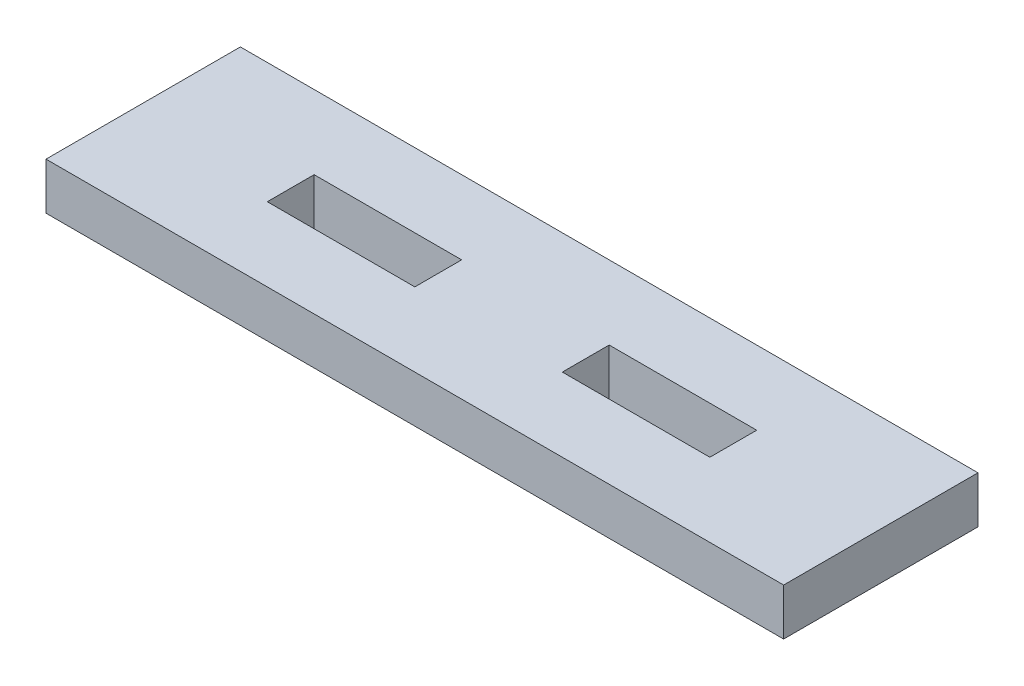
ISO-10303-21;
HEADER;
FILE_DESCRIPTION(('STEP AP214'),'2;1');
FILE_NAME('part.step','',(''),(''),'','','');
FILE_SCHEMA(('AUTOMOTIVE_DESIGN { 1 0 10303 214 1 1 1 1 }'));
ENDSEC;
DATA;
#1=APPLICATION_CONTEXT('core data for automotive mechanical design processes');
#2=APPLICATION_PROTOCOL_DEFINITION('international standard','automotive_design',2000,#1);
#3=PRODUCT_CONTEXT('',#1,'mechanical');
#4=PRODUCT('Part','Part','',(#3));
#5=PRODUCT_RELATED_PRODUCT_CATEGORY('part','',(#4));
#6=PRODUCT_DEFINITION_FORMATION('','',#4);
#7=PRODUCT_DEFINITION_CONTEXT('part definition',#1,'design');
#8=PRODUCT_DEFINITION('design','',#6,#7);
#9=PRODUCT_DEFINITION_SHAPE('','',#8);
#10=(LENGTH_UNIT() NAMED_UNIT(*) SI_UNIT(.MILLI.,.METRE.));
#11=(NAMED_UNIT(*) PLANE_ANGLE_UNIT() SI_UNIT($,.RADIAN.));
#12=(NAMED_UNIT(*) SI_UNIT($,.STERADIAN.) SOLID_ANGLE_UNIT());
#13=UNCERTAINTY_MEASURE_WITH_UNIT(LENGTH_MEASURE(1.E-05),#10,'distance_accuracy_value','');
#14=(GEOMETRIC_REPRESENTATION_CONTEXT(3) GLOBAL_UNCERTAINTY_ASSIGNED_CONTEXT((#13)) GLOBAL_UNIT_ASSIGNED_CONTEXT((#10,
#11,#12)) REPRESENTATION_CONTEXT('',''));
#15=CARTESIAN_POINT('',(0.,0.,0.));
#16=DIRECTION('',(0.,0.,1.));
#17=DIRECTION('',(1.,0.,0.));
#18=AXIS2_PLACEMENT_3D('',#15,#16,#17);
#19=CARTESIAN_POINT('',(0.,3.175,0.));
#20=DIRECTION('',(0.,-1.,0.));
#21=DIRECTION('',(0.,0.,-1.));
#22=AXIS2_PLACEMENT_3D('',#19,#20,#21);
#23=PLANE('',#22);
#24=DIRECTION('',(0.,0.,-1.));
#25=VECTOR('',#24,1.);
#26=CARTESIAN_POINT('',(20.,3.175,-5.));
#27=LINE('',#26,#25);
#28=CARTESIAN_POINT('',(20.,3.175,-5.));
#29=VERTEX_POINT('',#28);
#30=CARTESIAN_POINT('',(20.,3.175,-8.175));
#31=VERTEX_POINT('',#30);
#32=EDGE_CURVE('E158',#29,#31,#27,.T.);
#33=ORIENTED_EDGE('',*,*,#32,.F.);
#34=DIRECTION('',(1.,0.,0.));
#35=VECTOR('',#34,1.);
#36=CARTESIAN_POINT('',(10.,3.175,-5.));
#37=LINE('',#36,#35);
#38=CARTESIAN_POINT('',(10.,3.175,-5.));
#39=VERTEX_POINT('',#38);
#40=EDGE_CURVE('E166',#39,#29,#37,.T.);
#41=ORIENTED_EDGE('',*,*,#40,.F.);
#42=DIRECTION('',(0.,0.,1.));
#43=VECTOR('',#42,1.);
#44=CARTESIAN_POINT('',(10.,3.175,-5.));
#45=LINE('',#44,#43);
#46=CARTESIAN_POINT('',(10.,3.175,-8.175));
#47=VERTEX_POINT('',#46);
#48=EDGE_CURVE('E163',#47,#39,#45,.T.);
#49=ORIENTED_EDGE('',*,*,#48,.F.);
#50=DIRECTION('',(-1.,0.,0.));
#51=VECTOR('',#50,1.);
#52=CARTESIAN_POINT('',(10.,3.175,-8.175));
#53=LINE('',#52,#51);
#54=EDGE_CURVE('E160',#31,#47,#53,.T.);
#55=ORIENTED_EDGE('',*,*,#54,.F.);
#56=EDGE_LOOP('',(#33,#41,#49,#55));
#57=FACE_BOUND('',#56,.T.);
#58=DIRECTION('',(0.,0.,1.));
#59=VECTOR('',#58,1.);
#60=CARTESIAN_POINT('',(0.,3.175,0.));
#61=LINE('',#60,#59);
#62=CARTESIAN_POINT('',(0.,3.175,-13.175));
#63=VERTEX_POINT('',#62);
#64=CARTESIAN_POINT('',(0.,3.175,0.));
#65=VERTEX_POINT('',#64);
#66=EDGE_CURVE('E189',#63,#65,#61,.T.);
#67=ORIENTED_EDGE('',*,*,#66,.T.);
#68=DIRECTION('',(1.,0.,0.));
#69=VECTOR('',#68,1.);
#70=CARTESIAN_POINT('',(0.,3.175,0.));
#71=LINE('',#70,#69);
#72=CARTESIAN_POINT('',(50.,3.175,0.));
#73=VERTEX_POINT('',#72);
#74=EDGE_CURVE('E192',#65,#73,#71,.T.);
#75=ORIENTED_EDGE('',*,*,#74,.T.);
#76=DIRECTION('',(0.,0.,-1.));
#77=VECTOR('',#76,1.);
#78=CARTESIAN_POINT('',(50.,3.175,0.));
#79=LINE('',#78,#77);
#80=CARTESIAN_POINT('',(50.,3.175,-13.175));
#81=VERTEX_POINT('',#80);
#82=EDGE_CURVE('E195',#73,#81,#79,.T.);
#83=ORIENTED_EDGE('',*,*,#82,.T.);
#84=DIRECTION('',(-1.,0.,0.));
#85=VECTOR('',#84,1.);
#86=CARTESIAN_POINT('',(0.,3.175,-13.175));
#87=LINE('',#86,#85);
#88=EDGE_CURVE('E197',#81,#63,#87,.T.);
#89=ORIENTED_EDGE('',*,*,#88,.T.);
#90=EDGE_LOOP('',(#67,#75,#83,#89));
#91=FACE_BOUND('',#90,.T.);
#92=DIRECTION('',(0.,0.,-1.));
#93=VECTOR('',#92,1.);
#94=CARTESIAN_POINT('',(40.,3.175,-5.));
#95=LINE('',#94,#93);
#96=CARTESIAN_POINT('',(40.,3.175,-5.));
#97=VERTEX_POINT('',#96);
#98=CARTESIAN_POINT('',(40.,3.175,-8.175));
#99=VERTEX_POINT('',#98);
#100=EDGE_CURVE('E122',#97,#99,#95,.T.);
#101=ORIENTED_EDGE('',*,*,#100,.F.);
#102=DIRECTION('',(1.,0.,0.));
#103=VECTOR('',#102,1.);
#104=CARTESIAN_POINT('',(30.,3.175,-5.));
#105=LINE('',#104,#103);
#106=CARTESIAN_POINT('',(30.,3.175,-5.));
#107=VERTEX_POINT('',#106);
#108=EDGE_CURVE('E144',#107,#97,#105,.T.);
#109=ORIENTED_EDGE('',*,*,#108,.F.);
#110=DIRECTION('',(0.,0.,1.));
#111=VECTOR('',#110,1.);
#112=CARTESIAN_POINT('',(30.,3.175,-5.));
#113=LINE('',#112,#111);
#114=CARTESIAN_POINT('',(30.,3.175,-8.175));
#115=VERTEX_POINT('',#114);
#116=EDGE_CURVE('E142',#115,#107,#113,.T.);
#117=ORIENTED_EDGE('',*,*,#116,.F.);
#118=DIRECTION('',(-1.,0.,0.));
#119=VECTOR('',#118,1.);
#120=CARTESIAN_POINT('',(30.,3.175,-8.175));
#121=LINE('',#120,#119);
#122=EDGE_CURVE('E130',#99,#115,#121,.T.);
#123=ORIENTED_EDGE('',*,*,#122,.F.);
#124=EDGE_LOOP('',(#101,#109,#117,#123));
#125=FACE_BOUND('',#124,.T.);
#126=ADVANCED_FACE('F33',(#57,#91,#125),#23,.F.);
#127=CARTESIAN_POINT('',(0.,0.,0.));
#128=DIRECTION('',(0.,-1.,0.));
#129=DIRECTION('',(0.,0.,-1.));
#130=AXIS2_PLACEMENT_3D('',#127,#128,#129);
#131=PLANE('',#130);
#132=DIRECTION('',(0.,0.,1.));
#133=VECTOR('',#132,1.);
#134=CARTESIAN_POINT('',(0.,0.,0.));
#135=LINE('',#134,#133);
#136=CARTESIAN_POINT('',(0.,0.,-13.175));
#137=VERTEX_POINT('',#136);
#138=CARTESIAN_POINT('',(0.,0.,0.));
#139=VERTEX_POINT('',#138);
#140=EDGE_CURVE('E188',#137,#139,#135,.T.);
#141=ORIENTED_EDGE('',*,*,#140,.F.);
#142=DIRECTION('',(-1.,0.,0.));
#143=VECTOR('',#142,1.);
#144=CARTESIAN_POINT('',(0.,0.,-13.175));
#145=LINE('',#144,#143);
#146=CARTESIAN_POINT('',(50.,0.,-13.175));
#147=VERTEX_POINT('',#146);
#148=EDGE_CURVE('E193',#147,#137,#145,.T.);
#149=ORIENTED_EDGE('',*,*,#148,.F.);
#150=DIRECTION('',(0.,0.,-1.));
#151=VECTOR('',#150,1.);
#152=CARTESIAN_POINT('',(50.,0.,0.));
#153=LINE('',#152,#151);
#154=CARTESIAN_POINT('',(50.,0.,0.));
#155=VERTEX_POINT('',#154);
#156=EDGE_CURVE('E204',#155,#147,#153,.T.);
#157=ORIENTED_EDGE('',*,*,#156,.F.);
#158=DIRECTION('',(1.,0.,0.));
#159=VECTOR('',#158,1.);
#160=CARTESIAN_POINT('',(0.,0.,0.));
#161=LINE('',#160,#159);
#162=EDGE_CURVE('E202',#139,#155,#161,.T.);
#163=ORIENTED_EDGE('',*,*,#162,.F.);
#164=EDGE_LOOP('',(#141,#149,#157,#163));
#165=FACE_BOUND('',#164,.T.);
#166=DIRECTION('',(1.,0.,0.));
#167=VECTOR('',#166,1.);
#168=CARTESIAN_POINT('',(10.,0.,-5.));
#169=LINE('',#168,#167);
#170=CARTESIAN_POINT('',(10.,0.,-5.));
#171=VERTEX_POINT('',#170);
#172=CARTESIAN_POINT('',(20.,0.,-5.));
#173=VERTEX_POINT('',#172);
#174=EDGE_CURVE('E161',#171,#173,#169,.T.);
#175=ORIENTED_EDGE('',*,*,#174,.T.);
#176=DIRECTION('',(0.,0.,-1.));
#177=VECTOR('',#176,1.);
#178=CARTESIAN_POINT('',(20.,0.,-5.));
#179=LINE('',#178,#177);
#180=CARTESIAN_POINT('',(20.,0.,-8.175));
#181=VERTEX_POINT('',#180);
#182=EDGE_CURVE('E138',#173,#181,#179,.T.);
#183=ORIENTED_EDGE('',*,*,#182,.T.);
#184=DIRECTION('',(-1.,0.,0.));
#185=VECTOR('',#184,1.);
#186=CARTESIAN_POINT('',(10.,0.,-8.175));
#187=LINE('',#186,#185);
#188=CARTESIAN_POINT('',(10.,0.,-8.175));
#189=VERTEX_POINT('',#188);
#190=EDGE_CURVE('E171',#181,#189,#187,.T.);
#191=ORIENTED_EDGE('',*,*,#190,.T.);
#192=DIRECTION('',(0.,0.,1.));
#193=VECTOR('',#192,1.);
#194=CARTESIAN_POINT('',(10.,0.,-5.));
#195=LINE('',#194,#193);
#196=EDGE_CURVE('E174',#189,#171,#195,.T.);
#197=ORIENTED_EDGE('',*,*,#196,.T.);
#198=EDGE_LOOP('',(#175,#183,#191,#197));
#199=FACE_BOUND('',#198,.T.);
#200=DIRECTION('',(1.,0.,0.));
#201=VECTOR('',#200,1.);
#202=CARTESIAN_POINT('',(30.,0.,-5.));
#203=LINE('',#202,#201);
#204=CARTESIAN_POINT('',(30.,0.,-5.));
#205=VERTEX_POINT('',#204);
#206=CARTESIAN_POINT('',(40.,0.,-5.));
#207=VERTEX_POINT('',#206);
#208=EDGE_CURVE('E131',#205,#207,#203,.T.);
#209=ORIENTED_EDGE('',*,*,#208,.T.);
#210=DIRECTION('',(0.,0.,-1.));
#211=VECTOR('',#210,1.);
#212=CARTESIAN_POINT('',(40.,0.,-5.));
#213=LINE('',#212,#211);
#214=CARTESIAN_POINT('',(40.,0.,-8.175));
#215=VERTEX_POINT('',#214);
#216=EDGE_CURVE('E56',#207,#215,#213,.T.);
#217=ORIENTED_EDGE('',*,*,#216,.T.);
#218=DIRECTION('',(-1.,0.,0.));
#219=VECTOR('',#218,1.);
#220=CARTESIAN_POINT('',(30.,0.,-8.175));
#221=LINE('',#220,#219);
#222=CARTESIAN_POINT('',(30.,0.,-8.175));
#223=VERTEX_POINT('',#222);
#224=EDGE_CURVE('E137',#215,#223,#221,.T.);
#225=ORIENTED_EDGE('',*,*,#224,.T.);
#226=DIRECTION('',(0.,0.,1.));
#227=VECTOR('',#226,1.);
#228=CARTESIAN_POINT('',(30.,0.,-5.));
#229=LINE('',#228,#227);
#230=EDGE_CURVE('E150',#223,#205,#229,.T.);
#231=ORIENTED_EDGE('',*,*,#230,.T.);
#232=EDGE_LOOP('',(#209,#217,#225,#231));
#233=FACE_BOUND('',#232,.T.);
#234=ADVANCED_FACE('F222',(#165,#199,#233),#131,.T.);
#235=CARTESIAN_POINT('',(0.,3.175,0.));
#236=DIRECTION('',(1.,0.,0.));
#237=DIRECTION('',(0.,0.,-1.));
#238=AXIS2_PLACEMENT_3D('',#235,#236,#237);
#239=PLANE('',#238);
#240=ORIENTED_EDGE('',*,*,#140,.T.);
#241=DIRECTION('',(0.,-1.,0.));
#242=VECTOR('',#241,1.);
#243=CARTESIAN_POINT('',(0.,3.175,0.));
#244=LINE('',#243,#242);
#245=EDGE_CURVE('E11',#65,#139,#244,.T.);
#246=ORIENTED_EDGE('',*,*,#245,.F.);
#247=ORIENTED_EDGE('',*,*,#66,.F.);
#248=DIRECTION('',(0.,-1.,0.));
#249=VECTOR('',#248,1.);
#250=CARTESIAN_POINT('',(0.,3.175,-13.175));
#251=LINE('',#250,#249);
#252=EDGE_CURVE('E199',#63,#137,#251,.T.);
#253=ORIENTED_EDGE('',*,*,#252,.T.);
#254=EDGE_LOOP('',(#240,#246,#247,#253));
#255=FACE_BOUND('',#254,.T.);
#256=ADVANCED_FACE('F35',(#255),#239,.F.);
#257=CARTESIAN_POINT('',(0.,3.175,0.));
#258=DIRECTION('',(0.,0.,-1.));
#259=DIRECTION('',(-1.,0.,0.));
#260=AXIS2_PLACEMENT_3D('',#257,#258,#259);
#261=PLANE('',#260);
#262=ORIENTED_EDGE('',*,*,#162,.T.);
#263=DIRECTION('',(0.,-1.,0.));
#264=VECTOR('',#263,1.);
#265=CARTESIAN_POINT('',(50.,3.175,0.));
#266=LINE('',#265,#264);
#267=EDGE_CURVE('E41',#73,#155,#266,.T.);
#268=ORIENTED_EDGE('',*,*,#267,.F.);
#269=ORIENTED_EDGE('',*,*,#74,.F.);
#270=ORIENTED_EDGE('',*,*,#245,.T.);
#271=EDGE_LOOP('',(#262,#268,#269,#270));
#272=FACE_BOUND('',#271,.T.);
#273=ADVANCED_FACE('F232',(#272),#261,.F.);
#274=CARTESIAN_POINT('',(50.,3.175,0.));
#275=DIRECTION('',(-1.,0.,0.));
#276=DIRECTION('',(0.,0.,1.));
#277=AXIS2_PLACEMENT_3D('',#274,#275,#276);
#278=PLANE('',#277);
#279=ORIENTED_EDGE('',*,*,#156,.T.);
#280=DIRECTION('',(0.,-1.,0.));
#281=VECTOR('',#280,1.);
#282=CARTESIAN_POINT('',(50.,3.175,-13.175));
#283=LINE('',#282,#281);
#284=EDGE_CURVE('E209',#81,#147,#283,.T.);
#285=ORIENTED_EDGE('',*,*,#284,.F.);
#286=ORIENTED_EDGE('',*,*,#82,.F.);
#287=ORIENTED_EDGE('',*,*,#267,.T.);
#288=EDGE_LOOP('',(#279,#285,#286,#287));
#289=FACE_BOUND('',#288,.T.);
#290=ADVANCED_FACE('F216',(#289),#278,.F.);
#291=CARTESIAN_POINT('',(0.,3.175,-13.175));
#292=DIRECTION('',(0.,0.,1.));
#293=DIRECTION('',(1.,0.,0.));
#294=AXIS2_PLACEMENT_3D('',#291,#292,#293);
#295=PLANE('',#294);
#296=ORIENTED_EDGE('',*,*,#148,.T.);
#297=ORIENTED_EDGE('',*,*,#252,.F.);
#298=ORIENTED_EDGE('',*,*,#88,.F.);
#299=ORIENTED_EDGE('',*,*,#284,.T.);
#300=EDGE_LOOP('',(#296,#297,#298,#299));
#301=FACE_BOUND('',#300,.T.);
#302=ADVANCED_FACE('F226',(#301),#295,.F.);
#303=CARTESIAN_POINT('',(20.,3.175,-5.));
#304=DIRECTION('',(-1.,0.,0.));
#305=DIRECTION('',(0.,0.,1.));
#306=AXIS2_PLACEMENT_3D('',#303,#304,#305);
#307=PLANE('',#306);
#308=ORIENTED_EDGE('',*,*,#182,.F.);
#309=DIRECTION('',(0.,-1.,0.));
#310=VECTOR('',#309,1.);
#311=CARTESIAN_POINT('',(20.,3.175,-5.));
#312=LINE('',#311,#310);
#313=EDGE_CURVE('E168',#29,#173,#312,.T.);
#314=ORIENTED_EDGE('',*,*,#313,.F.);
#315=ORIENTED_EDGE('',*,*,#32,.T.);
#316=DIRECTION('',(0.,-1.,0.));
#317=VECTOR('',#316,1.);
#318=CARTESIAN_POINT('',(20.,3.175,-8.175));
#319=LINE('',#318,#317);
#320=EDGE_CURVE('E185',#31,#181,#319,.T.);
#321=ORIENTED_EDGE('',*,*,#320,.T.);
#322=EDGE_LOOP('',(#308,#314,#315,#321));
#323=FACE_BOUND('',#322,.T.);
#324=ADVANCED_FACE('F248',(#323),#307,.T.);
#325=CARTESIAN_POINT('',(10.,3.175,-8.175));
#326=DIRECTION('',(0.,0.,1.));
#327=DIRECTION('',(1.,0.,0.));
#328=AXIS2_PLACEMENT_3D('',#325,#326,#327);
#329=PLANE('',#328);
#330=ORIENTED_EDGE('',*,*,#190,.F.);
#331=ORIENTED_EDGE('',*,*,#320,.F.);
#332=ORIENTED_EDGE('',*,*,#54,.T.);
#333=DIRECTION('',(0.,-1.,0.));
#334=VECTOR('',#333,1.);
#335=CARTESIAN_POINT('',(10.,3.175,-8.175));
#336=LINE('',#335,#334);
#337=EDGE_CURVE('E183',#47,#189,#336,.T.);
#338=ORIENTED_EDGE('',*,*,#337,.T.);
#339=EDGE_LOOP('',(#330,#331,#332,#338));
#340=FACE_BOUND('',#339,.T.);
#341=ADVANCED_FACE('F255',(#340),#329,.T.);
#342=CARTESIAN_POINT('',(10.,3.175,-5.));
#343=DIRECTION('',(1.,0.,0.));
#344=DIRECTION('',(0.,0.,-1.));
#345=AXIS2_PLACEMENT_3D('',#342,#343,#344);
#346=PLANE('',#345);
#347=ORIENTED_EDGE('',*,*,#196,.F.);
#348=ORIENTED_EDGE('',*,*,#337,.F.);
#349=ORIENTED_EDGE('',*,*,#48,.T.);
#350=DIRECTION('',(0.,-1.,0.));
#351=VECTOR('',#350,1.);
#352=CARTESIAN_POINT('',(10.,3.175,-5.));
#353=LINE('',#352,#351);
#354=EDGE_CURVE('E181',#39,#171,#353,.T.);
#355=ORIENTED_EDGE('',*,*,#354,.T.);
#356=EDGE_LOOP('',(#347,#348,#349,#355));
#357=FACE_BOUND('',#356,.T.);
#358=ADVANCED_FACE('F260',(#357),#346,.T.);
#359=CARTESIAN_POINT('',(10.,3.175,-5.));
#360=DIRECTION('',(0.,0.,-1.));
#361=DIRECTION('',(-1.,0.,0.));
#362=AXIS2_PLACEMENT_3D('',#359,#360,#361);
#363=PLANE('',#362);
#364=ORIENTED_EDGE('',*,*,#174,.F.);
#365=ORIENTED_EDGE('',*,*,#354,.F.);
#366=ORIENTED_EDGE('',*,*,#40,.T.);
#367=ORIENTED_EDGE('',*,*,#313,.T.);
#368=EDGE_LOOP('',(#364,#365,#366,#367));
#369=FACE_BOUND('',#368,.T.);
#370=ADVANCED_FACE('F266',(#369),#363,.T.);
#371=CARTESIAN_POINT('',(40.,3.175,-5.));
#372=DIRECTION('',(-1.,0.,0.));
#373=DIRECTION('',(0.,0.,1.));
#374=AXIS2_PLACEMENT_3D('',#371,#372,#373);
#375=PLANE('',#374);
#376=ORIENTED_EDGE('',*,*,#216,.F.);
#377=DIRECTION('',(0.,-1.,0.));
#378=VECTOR('',#377,1.);
#379=CARTESIAN_POINT('',(40.,3.175,-5.));
#380=LINE('',#379,#378);
#381=EDGE_CURVE('E126',#97,#207,#380,.T.);
#382=ORIENTED_EDGE('',*,*,#381,.F.);
#383=ORIENTED_EDGE('',*,*,#100,.T.);
#384=DIRECTION('',(0.,-1.,0.));
#385=VECTOR('',#384,1.);
#386=CARTESIAN_POINT('',(40.,3.175,-8.175));
#387=LINE('',#386,#385);
#388=EDGE_CURVE('E125',#99,#215,#387,.T.);
#389=ORIENTED_EDGE('',*,*,#388,.T.);
#390=EDGE_LOOP('',(#376,#382,#383,#389));
#391=FACE_BOUND('',#390,.T.);
#392=ADVANCED_FACE('F124',(#391),#375,.T.);
#393=CARTESIAN_POINT('',(30.,3.175,-8.175));
#394=DIRECTION('',(0.,0.,1.));
#395=DIRECTION('',(1.,0.,0.));
#396=AXIS2_PLACEMENT_3D('',#393,#394,#395);
#397=PLANE('',#396);
#398=ORIENTED_EDGE('',*,*,#224,.F.);
#399=ORIENTED_EDGE('',*,*,#388,.F.);
#400=ORIENTED_EDGE('',*,*,#122,.T.);
#401=DIRECTION('',(0.,-1.,0.));
#402=VECTOR('',#401,1.);
#403=CARTESIAN_POINT('',(30.,3.175,-8.175));
#404=LINE('',#403,#402);
#405=EDGE_CURVE('E139',#115,#223,#404,.T.);
#406=ORIENTED_EDGE('',*,*,#405,.T.);
#407=EDGE_LOOP('',(#398,#399,#400,#406));
#408=FACE_BOUND('',#407,.T.);
#409=ADVANCED_FACE('F134',(#408),#397,.T.);
#410=CARTESIAN_POINT('',(30.,3.175,-5.));
#411=DIRECTION('',(1.,0.,0.));
#412=DIRECTION('',(0.,0.,-1.));
#413=AXIS2_PLACEMENT_3D('',#410,#411,#412);
#414=PLANE('',#413);
#415=ORIENTED_EDGE('',*,*,#230,.F.);
#416=ORIENTED_EDGE('',*,*,#405,.F.);
#417=ORIENTED_EDGE('',*,*,#116,.T.);
#418=DIRECTION('',(0.,-1.,0.));
#419=VECTOR('',#418,1.);
#420=CARTESIAN_POINT('',(30.,3.175,-5.));
#421=LINE('',#420,#419);
#422=EDGE_CURVE('E48',#107,#205,#421,.T.);
#423=ORIENTED_EDGE('',*,*,#422,.T.);
#424=EDGE_LOOP('',(#415,#416,#417,#423));
#425=FACE_BOUND('',#424,.T.);
#426=ADVANCED_FACE('F285',(#425),#414,.T.);
#427=CARTESIAN_POINT('',(30.,3.175,-5.));
#428=DIRECTION('',(0.,0.,-1.));
#429=DIRECTION('',(-1.,0.,0.));
#430=AXIS2_PLACEMENT_3D('',#427,#428,#429);
#431=PLANE('',#430);
#432=ORIENTED_EDGE('',*,*,#208,.F.);
#433=ORIENTED_EDGE('',*,*,#422,.F.);
#434=ORIENTED_EDGE('',*,*,#108,.T.);
#435=ORIENTED_EDGE('',*,*,#381,.T.);
#436=EDGE_LOOP('',(#432,#433,#434,#435));
#437=FACE_BOUND('',#436,.T.);
#438=ADVANCED_FACE('F288',(#437),#431,.T.);
#439=CLOSED_SHELL('',(#126,#234,#256,#273,#290,#302,#324,#341,#358,#370,#392,#409,#426,#438));
#440=MANIFOLD_SOLID_BREP('B2',#439);
#441=ADVANCED_BREP_SHAPE_REPRESENTATION('',(#18,#440),#14);
#442=SHAPE_DEFINITION_REPRESENTATION(#9,#441);
ENDSEC;
END-ISO-10303-21;
